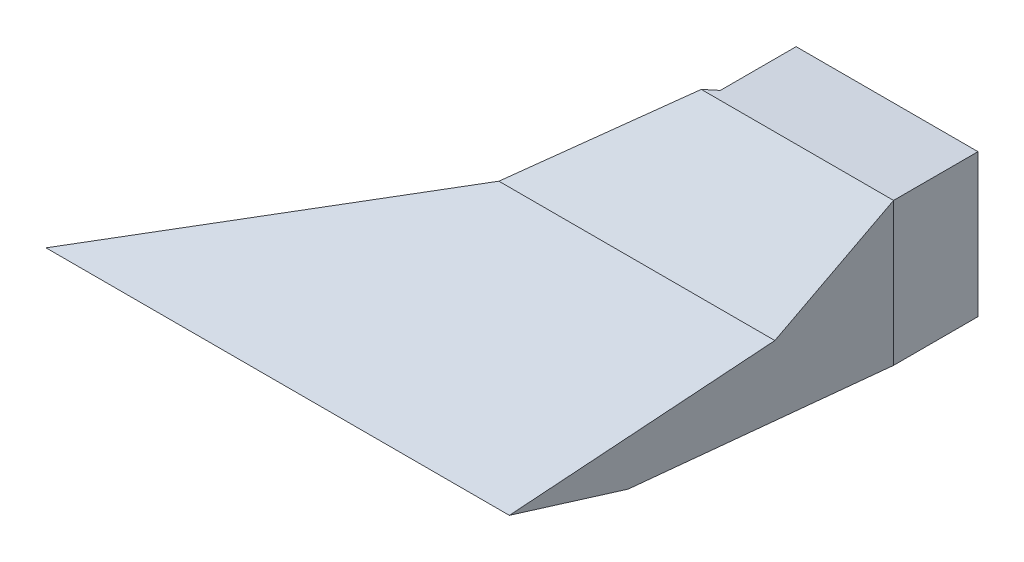
ISO-10303-21;
HEADER;
FILE_DESCRIPTION(('STEP AP214'),'2;1');
FILE_NAME('part.step','',(''),(''),'','','');
FILE_SCHEMA(('AUTOMOTIVE_DESIGN { 1 0 10303 214 1 1 1 1 }'));
ENDSEC;
DATA;
#1=APPLICATION_CONTEXT('core data for automotive mechanical design processes');
#2=APPLICATION_PROTOCOL_DEFINITION('international standard','automotive_design',2000,#1);
#3=PRODUCT_CONTEXT('',#1,'mechanical');
#4=PRODUCT('Part','Part','',(#3));
#5=PRODUCT_RELATED_PRODUCT_CATEGORY('part','',(#4));
#6=PRODUCT_DEFINITION_FORMATION('','',#4);
#7=PRODUCT_DEFINITION_CONTEXT('part definition',#1,'design');
#8=PRODUCT_DEFINITION('design','',#6,#7);
#9=PRODUCT_DEFINITION_SHAPE('','',#8);
#10=(LENGTH_UNIT() NAMED_UNIT(*) SI_UNIT(.MILLI.,.METRE.));
#11=(NAMED_UNIT(*) PLANE_ANGLE_UNIT() SI_UNIT($,.RADIAN.));
#12=(NAMED_UNIT(*) SI_UNIT($,.STERADIAN.) SOLID_ANGLE_UNIT());
#13=UNCERTAINTY_MEASURE_WITH_UNIT(LENGTH_MEASURE(1.E-05),#10,'distance_accuracy_value','');
#14=(GEOMETRIC_REPRESENTATION_CONTEXT(3) GLOBAL_UNCERTAINTY_ASSIGNED_CONTEXT((#13)) GLOBAL_UNIT_ASSIGNED_CONTEXT((#10,
#11,#12)) REPRESENTATION_CONTEXT('',''));
#15=CARTESIAN_POINT('',(0.,0.,0.));
#16=DIRECTION('',(0.,0.,1.));
#17=DIRECTION('',(1.,0.,0.));
#18=AXIS2_PLACEMENT_3D('',#15,#16,#17);
#19=CARTESIAN_POINT('',(50.,12.4,-7.9));
#20=DIRECTION('',(-1.,0.,0.));
#21=DIRECTION('',(0.,0.,1.));
#22=AXIS2_PLACEMENT_3D('',#19,#20,#21);
#23=PLANE('',#22);
#24=DIRECTION('',(0.,-1.,0.));
#25=VECTOR('',#24,1.);
#26=CARTESIAN_POINT('',(50.,12.4,-7.8));
#27=LINE('',#26,#25);
#28=CARTESIAN_POINT('',(50.,12.4,-7.8));
#29=VERTEX_POINT('',#28);
#30=CARTESIAN_POINT('',(50.,0.811035004039767,-7.8));
#31=VERTEX_POINT('',#30);
#32=EDGE_CURVE('E142',#29,#31,#27,.T.);
#33=ORIENTED_EDGE('',*,*,#32,.T.);
#34=DIRECTION('',(0.,0.,1.));
#35=VECTOR('',#34,1.);
#36=CARTESIAN_POINT('',(50.,0.811035004039767,-7.9));
#37=LINE('',#36,#35);
#38=CARTESIAN_POINT('',(50.,0.811035004039767,-7.9));
#39=VERTEX_POINT('',#38);
#40=EDGE_CURVE('E13',#39,#31,#37,.T.);
#41=ORIENTED_EDGE('',*,*,#40,.F.);
#42=DIRECTION('',(0.,-1.,0.));
#43=VECTOR('',#42,1.);
#44=CARTESIAN_POINT('',(50.,12.4,-7.9));
#45=LINE('',#44,#43);
#46=CARTESIAN_POINT('',(50.,12.4,-7.9));
#47=VERTEX_POINT('',#46);
#48=EDGE_CURVE('E130',#47,#39,#45,.T.);
#49=ORIENTED_EDGE('',*,*,#48,.F.);
#50=DIRECTION('',(0.,0.,1.));
#51=VECTOR('',#50,1.);
#52=CARTESIAN_POINT('',(50.,12.4,-7.9));
#53=LINE('',#52,#51);
#54=EDGE_CURVE('E138',#47,#29,#53,.T.);
#55=ORIENTED_EDGE('',*,*,#54,.T.);
#56=EDGE_LOOP('',(#33,#41,#49,#55));
#57=FACE_BOUND('',#56,.T.);
#58=ADVANCED_FACE('F79',(#57),#23,.F.);
#59=CARTESIAN_POINT('',(50.,0.811035004039767,-7.9));
#60=DIRECTION('',(0.,1.,0.));
#61=DIRECTION('',(0.,0.,1.));
#62=AXIS2_PLACEMENT_3D('',#59,#60,#61);
#63=PLANE('',#62);
#64=DIRECTION('',(-1.,0.,0.));
#65=VECTOR('',#64,1.);
#66=CARTESIAN_POINT('',(50.,0.811035004039767,-7.8));
#67=LINE('',#66,#65);
#68=CARTESIAN_POINT('',(34.8,0.811035004039767,-7.8));
#69=VERTEX_POINT('',#68);
#70=EDGE_CURVE('E134',#31,#69,#67,.T.);
#71=ORIENTED_EDGE('',*,*,#70,.T.);
#72=DIRECTION('',(0.,0.,1.));
#73=VECTOR('',#72,1.);
#74=CARTESIAN_POINT('',(34.8,0.811035004039767,-7.9));
#75=LINE('',#74,#73);
#76=CARTESIAN_POINT('',(34.8,0.811035004039767,-7.9));
#77=VERTEX_POINT('',#76);
#78=EDGE_CURVE('E87',#77,#69,#75,.T.);
#79=ORIENTED_EDGE('',*,*,#78,.F.);
#80=DIRECTION('',(-1.,0.,0.));
#81=VECTOR('',#80,1.);
#82=CARTESIAN_POINT('',(50.,0.811035004039767,-7.9));
#83=LINE('',#82,#81);
#84=EDGE_CURVE('E125',#39,#77,#83,.T.);
#85=ORIENTED_EDGE('',*,*,#84,.F.);
#86=ORIENTED_EDGE('',*,*,#40,.T.);
#87=EDGE_LOOP('',(#71,#79,#85,#86));
#88=FACE_BOUND('',#87,.T.);
#89=ADVANCED_FACE('F133',(#88),#63,.F.);
#90=CARTESIAN_POINT('',(34.8,12.4,-7.9));
#91=DIRECTION('',(1.,0.,0.));
#92=DIRECTION('',(0.,0.,-1.));
#93=AXIS2_PLACEMENT_3D('',#90,#91,#92);
#94=PLANE('',#93);
#95=DIRECTION('',(0.,1.,0.));
#96=VECTOR('',#95,1.);
#97=CARTESIAN_POINT('',(34.8,12.4,-7.8));
#98=LINE('',#97,#96);
#99=CARTESIAN_POINT('',(34.8,12.4,-7.8));
#100=VERTEX_POINT('',#99);
#101=EDGE_CURVE('E112',#69,#100,#98,.T.);
#102=ORIENTED_EDGE('',*,*,#101,.T.);
#103=DIRECTION('',(0.,0.,1.));
#104=VECTOR('',#103,1.);
#105=CARTESIAN_POINT('',(34.8,12.4,-7.9));
#106=LINE('',#105,#104);
#107=CARTESIAN_POINT('',(34.8,12.4,-7.9));
#108=VERTEX_POINT('',#107);
#109=EDGE_CURVE('E135',#108,#100,#106,.T.);
#110=ORIENTED_EDGE('',*,*,#109,.F.);
#111=DIRECTION('',(0.,1.,0.));
#112=VECTOR('',#111,1.);
#113=CARTESIAN_POINT('',(34.8,12.4,-7.9));
#114=LINE('',#113,#112);
#115=EDGE_CURVE('E128',#77,#108,#114,.T.);
#116=ORIENTED_EDGE('',*,*,#115,.F.);
#117=ORIENTED_EDGE('',*,*,#78,.T.);
#118=EDGE_LOOP('',(#102,#110,#116,#117));
#119=FACE_BOUND('',#118,.T.);
#120=ADVANCED_FACE('F136',(#119),#94,.F.);
#121=CARTESIAN_POINT('',(50.,12.4,-7.9));
#122=DIRECTION('',(0.,-1.,0.));
#123=DIRECTION('',(0.,0.,-1.));
#124=AXIS2_PLACEMENT_3D('',#121,#122,#123);
#125=PLANE('',#124);
#126=DIRECTION('',(1.,0.,0.));
#127=VECTOR('',#126,1.);
#128=CARTESIAN_POINT('',(50.,12.4,-7.8));
#129=LINE('',#128,#127);
#130=EDGE_CURVE('E118',#100,#29,#129,.T.);
#131=ORIENTED_EDGE('',*,*,#130,.T.);
#132=ORIENTED_EDGE('',*,*,#54,.F.);
#133=DIRECTION('',(1.,0.,0.));
#134=VECTOR('',#133,1.);
#135=CARTESIAN_POINT('',(50.,12.4,-7.9));
#136=LINE('',#135,#134);
#137=EDGE_CURVE('E95',#108,#47,#136,.T.);
#138=ORIENTED_EDGE('',*,*,#137,.F.);
#139=ORIENTED_EDGE('',*,*,#109,.T.);
#140=EDGE_LOOP('',(#131,#132,#138,#139));
#141=FACE_BOUND('',#140,.T.);
#142=ADVANCED_FACE('F149',(#141),#125,.F.);
#143=CARTESIAN_POINT('',(0.,0.,-7.9));
#144=DIRECTION('',(0.,0.,-1.));
#145=DIRECTION('',(-1.,0.,0.));
#146=AXIS2_PLACEMENT_3D('',#143,#144,#145);
#147=PLANE('',#146);
#148=ORIENTED_EDGE('',*,*,#48,.T.);
#149=ORIENTED_EDGE('',*,*,#84,.T.);
#150=ORIENTED_EDGE('',*,*,#115,.T.);
#151=ORIENTED_EDGE('',*,*,#137,.T.);
#152=EDGE_LOOP('',(#148,#149,#150,#151));
#153=FACE_BOUND('',#152,.T.);
#154=ADVANCED_FACE('F126',(#153),#147,.T.);
#155=CARTESIAN_POINT('',(0.,0.,-7.8));
#156=DIRECTION('',(0.,0.,-1.));
#157=DIRECTION('',(-1.,0.,0.));
#158=AXIS2_PLACEMENT_3D('',#155,#156,#157);
#159=PLANE('',#158);
#160=ORIENTED_EDGE('',*,*,#32,.F.);
#161=ORIENTED_EDGE('',*,*,#130,.F.);
#162=ORIENTED_EDGE('',*,*,#101,.F.);
#163=ORIENTED_EDGE('',*,*,#70,.F.);
#164=EDGE_LOOP('',(#160,#161,#162,#163));
#165=FACE_BOUND('',#164,.T.);
#166=ADVANCED_FACE('F152',(#165),#159,.F.);
#167=CLOSED_SHELL('',(#58,#89,#120,#142,#154,#166));
#168=MANIFOLD_SOLID_BREP('B2',#167);
#169=CARTESIAN_POINT('',(500000.,4.3108780250244,8.05331003636857));
#170=DIRECTION('',(0.,0.934304423232793,0.356476148890271));
#171=DIRECTION('',(0.,-0.356476148890271,0.934304423232793));
#172=AXIS2_PLACEMENT_3D('',#169,#170,#171);
#173=PLANE('',#172);
#174=DIRECTION('',(0.746771710863164,0.237085319362281,-0.621387611074914));
#175=VECTOR('',#174,1.);
#176=CARTESIAN_POINT('',(3.35260043874305,-2.43824431142607,25.742389296028));
#177=LINE('',#176,#175);
#178=CARTESIAN_POINT('',(3.35260043879571,-2.43824431143239,25.7423892959974));
#179=VERTEX_POINT('',#178);
#180=CARTESIAN_POINT('',(24.6109965621883,4.31087802505243,8.05331003634986));
#181=VERTEX_POINT('',#180);
#182=EDGE_CURVE('E224',#179,#181,#177,.T.);
#183=ORIENTED_EDGE('',*,*,#182,.T.);
#184=DIRECTION('',(-1.,0.,0.));
#185=VECTOR('',#184,1.);
#186=CARTESIAN_POINT('',(500000.,4.3108780250244,8.05331003636857));
#187=LINE('',#186,#185);
#188=CARTESIAN_POINT('',(47.6232973339279,4.3108780250169,8.05331003637117));
#189=VERTEX_POINT('',#188);
#190=EDGE_CURVE('E362',#189,#181,#187,.T.);
#191=ORIENTED_EDGE('',*,*,#190,.F.);
#192=DIRECTION('',(-0.262359194005535,-0.343988891430772,0.901576006719897));
#193=VECTOR('',#192,1.);
#194=CARTESIAN_POINT('',(42.4757639670978,-2.43824431142607,25.7423892960262));
#195=LINE('',#194,#193);
#196=CARTESIAN_POINT('',(42.4757639670013,-2.43824431142607,25.7423892960022));
#197=VERTEX_POINT('',#196);
#198=EDGE_CURVE('E481',#189,#197,#195,.T.);
#199=ORIENTED_EDGE('',*,*,#198,.T.);
#200=DIRECTION('',(-1.,0.,0.));
#201=VECTOR('',#200,1.);
#202=CARTESIAN_POINT('',(500000.,-2.43824431143155,25.7423892960052));
#203=LINE('',#202,#201);
#204=EDGE_CURVE('E417',#197,#179,#203,.T.);
#205=ORIENTED_EDGE('',*,*,#204,.T.);
#206=EDGE_LOOP('',(#183,#191,#199,#205));
#207=FACE_BOUND('',#206,.T.);
#208=ADVANCED_FACE('F207',(#207),#173,.F.);
#209=CARTESIAN_POINT('',(500000.,12.0878691271867,0.));
#210=DIRECTION('',(0.,0.719339800338652,0.694658370458996));
#211=DIRECTION('',(0.,-0.694658370458996,0.719339800338652));
#212=AXIS2_PLACEMENT_3D('',#209,#210,#211);
#213=PLANE('',#212);
#214=DIRECTION('',(0.653989150920572,0.525511784676704,-0.544183383285538));
#215=VECTOR('',#214,1.);
#216=CARTESIAN_POINT('',(24.610996562059,4.31087802503822,8.05331003633974));
#217=LINE('',#216,#215);
#218=CARTESIAN_POINT('',(34.289310076468,12.0878691271867,0.));
#219=VERTEX_POINT('',#218);
#220=EDGE_CURVE('E358',#181,#219,#217,.T.);
#221=ORIENTED_EDGE('',*,*,#220,.T.);
#222=DIRECTION('',(-1.,0.,0.));
#223=VECTOR('',#222,1.);
#224=CARTESIAN_POINT('',(500000.,12.0878691271867,0.));
#225=LINE('',#224,#223);
#226=CARTESIAN_POINT('',(34.8,12.0878691271867,0.));
#227=VERTEX_POINT('',#226);
#228=EDGE_CURVE('E355',#227,#219,#225,.T.);
#229=ORIENTED_EDGE('',*,*,#228,.F.);
#230=DIRECTION('',(0.,0.694658370458996,-0.719339800338652));
#231=VECTOR('',#230,1.);
#232=CARTESIAN_POINT('',(34.8,2.90200435136843,9.51224143374082));
#233=LINE('',#232,#231);
#234=CARTESIAN_POINT('',(34.8,12.4,-0.323220980668114));
#235=VERTEX_POINT('',#234);
#236=EDGE_CURVE('E344',#227,#235,#233,.T.);
#237=ORIENTED_EDGE('',*,*,#236,.T.);
#238=DIRECTION('',(1.,0.,0.));
#239=VECTOR('',#238,1.);
#240=CARTESIAN_POINT('',(50.,12.4,-0.323220980668119));
#241=LINE('',#240,#239);
#242=CARTESIAN_POINT('',(50.,12.4,-0.323220980668119));
#243=VERTEX_POINT('',#242);
#244=EDGE_CURVE('E555',#235,#243,#241,.T.);
#245=ORIENTED_EDGE('',*,*,#244,.T.);
#246=DIRECTION('',(0.,-0.694658370458996,0.719339800338652));
#247=VECTOR('',#246,1.);
#248=CARTESIAN_POINT('',(50.,2.90200435136843,9.51224143374082));
#249=LINE('',#248,#247);
#250=CARTESIAN_POINT('',(50.,12.0878691271867,0.));
#251=VERTEX_POINT('',#250);
#252=EDGE_CURVE('E553',#243,#251,#249,.T.);
#253=ORIENTED_EDGE('',*,*,#252,.T.);
#254=CARTESIAN_POINT('',(49.9668157,12.0878691271867,0.));
#255=VERTEX_POINT('',#254);
#256=EDGE_CURVE('E361',#251,#255,#225,.T.);
#257=ORIENTED_EDGE('',*,*,#256,.T.);
#258=DIRECTION('',(-0.204887549377378,-0.679921553624081,0.704079379777272));
#259=VECTOR('',#258,1.);
#260=CARTESIAN_POINT('',(47.6232973338611,4.31087802502401,8.05331003636846));
#261=LINE('',#260,#259);
#262=EDGE_CURVE('E479',#255,#189,#261,.T.);
#263=ORIENTED_EDGE('',*,*,#262,.T.);
#264=ORIENTED_EDGE('',*,*,#190,.T.);
#265=EDGE_LOOP('',(#221,#229,#237,#245,#253,#257,#263,#264));
#266=FACE_BOUND('',#265,.T.);
#267=ADVANCED_FACE('F356',(#266),#213,.F.);
#268=CARTESIAN_POINT('',(500000.,0.811035004039765,0.));
#269=DIRECTION('',(0.,-0.986393923832144,-0.164398987305357));
#270=DIRECTION('',(0.,0.164398987305357,-0.986393923832144));
#271=AXIS2_PLACEMENT_3D('',#268,#269,#270);
#272=PLANE('',#271);
#273=DIRECTION('',(-0.764356936022371,-0.106003375055101,0.636020250331246));
#274=VECTOR('',#273,1.);
#275=CARTESIAN_POINT('',(34.2893100765124,0.811035004043993,-4.1977519414938E-11));
#276=LINE('',#275,#274);
#277=CARTESIAN_POINT('',(34.289310076468,0.811035004039765,0.));
#278=VERTEX_POINT('',#277);
#279=CARTESIAN_POINT('',(11.455474554964,-2.35563166262691,19.));
#280=VERTEX_POINT('',#279);
#281=EDGE_CURVE('E232',#278,#280,#276,.T.);
#282=ORIENTED_EDGE('',*,*,#281,.T.);
#283=DIRECTION('',(-1.,0.,0.));
#284=VECTOR('',#283,1.);
#285=CARTESIAN_POINT('',(500000.,-2.35563166262691,19.));
#286=LINE('',#285,#284);
#287=CARTESIAN_POINT('',(44.4378035601858,-2.35563166262691,19.));
#288=VERTEX_POINT('',#287);
#289=EDGE_CURVE('E405',#288,#280,#286,.T.);
#290=ORIENTED_EDGE('',*,*,#289,.F.);
#291=DIRECTION('',(0.275900130811224,0.158018055572697,-0.948108333436308));
#292=VECTOR('',#291,1.);
#293=CARTESIAN_POINT('',(49.9668157,0.811035004039765,0.));
#294=LINE('',#293,#292);
#295=CARTESIAN_POINT('',(49.966815700017,0.811035004039765,-4.21446934100766E-12));
#296=VERTEX_POINT('',#295);
#297=EDGE_CURVE('E470',#288,#296,#294,.T.);
#298=ORIENTED_EDGE('',*,*,#297,.T.);
#299=DIRECTION('',(-1.,0.,0.));
#300=VECTOR('',#299,1.);
#301=CARTESIAN_POINT('',(500000.,0.811035004039765,0.));
#302=LINE('',#301,#300);
#303=CARTESIAN_POINT('',(34.8000000000184,0.811035004039765,0.));
#304=VERTEX_POINT('',#303);
#305=EDGE_CURVE('E412',#296,#304,#302,.T.);
#306=ORIENTED_EDGE('',*,*,#305,.T.);
#307=EDGE_CURVE('E366',#304,#278,#302,.T.);
#308=ORIENTED_EDGE('',*,*,#307,.T.);
#309=EDGE_LOOP('',(#282,#290,#298,#306,#308));
#310=FACE_BOUND('',#309,.T.);
#311=ADVANCED_FACE('F587',(#310),#272,.F.);
#312=CARTESIAN_POINT('',(500000.,-2.35563166262691,19.));
#313=DIRECTION('',(0.,0.,-1.));
#314=DIRECTION('',(-1.,0.,0.));
#315=AXIS2_PLACEMENT_3D('',#312,#313,#314);
#316=PLANE('',#315);
#317=DIRECTION('',(3.84146596304198E-12,-1.,-3.19979570195479E-12));
#318=VECTOR('',#317,1.);
#319=CARTESIAN_POINT('',(11.4554745549304,-2.35563166262691,19.0000000000025));
#320=LINE('',#319,#318);
#321=CARTESIAN_POINT('',(11.4554745549335,-3.16666666666666,19.));
#322=VERTEX_POINT('',#321);
#323=EDGE_CURVE('E545',#280,#322,#320,.T.);
#324=ORIENTED_EDGE('',*,*,#323,.T.);
#325=DIRECTION('',(-1.,0.,0.));
#326=VECTOR('',#325,1.);
#327=CARTESIAN_POINT('',(0.8,-3.16666666666666,19.));
#328=LINE('',#327,#326);
#329=CARTESIAN_POINT('',(44.4378035601858,-3.16666666666666,19.));
#330=VERTEX_POINT('',#329);
#331=EDGE_CURVE('E438',#330,#322,#328,.T.);
#332=ORIENTED_EDGE('',*,*,#331,.F.);
#333=DIRECTION('',(0.,1.,0.));
#334=VECTOR('',#333,1.);
#335=CARTESIAN_POINT('',(44.437803560201,-2.35563166262691,19.0000000000026));
#336=LINE('',#335,#334);
#337=EDGE_CURVE('E486',#330,#288,#336,.T.);
#338=ORIENTED_EDGE('',*,*,#337,.T.);
#339=ORIENTED_EDGE('',*,*,#289,.T.);
#340=EDGE_LOOP('',(#324,#332,#338,#339));
#341=FACE_BOUND('',#340,.T.);
#342=ADVANCED_FACE('F585',(#341),#316,.F.);
#343=CARTESIAN_POINT('',(0.,0.,0.));
#344=DIRECTION('',(0.,0.,1.));
#345=DIRECTION('',(1.,0.,0.));
#346=AXIS2_PLACEMENT_3D('',#343,#344,#345);
#347=PLANE('',#346);
#348=ORIENTED_EDGE('',*,*,#228,.T.);
#349=DIRECTION('',(5.08933543337628E-12,-1.,-4.23649793964402E-12));
#350=VECTOR('',#349,1.);
#351=CARTESIAN_POINT('',(34.289310076455,12.0878691271867,5.79676511346331E-12));
#352=LINE('',#351,#350);
#353=EDGE_CURVE('E550',#219,#278,#352,.T.);
#354=ORIENTED_EDGE('',*,*,#353,.T.);
#355=ORIENTED_EDGE('',*,*,#307,.F.);
#356=DIRECTION('',(0.,1.,0.));
#357=VECTOR('',#356,1.);
#358=CARTESIAN_POINT('',(34.8,0.811035004039765,0.));
#359=LINE('',#358,#357);
#360=EDGE_CURVE('E348',#304,#227,#359,.T.);
#361=ORIENTED_EDGE('',*,*,#360,.T.);
#362=EDGE_LOOP('',(#348,#354,#355,#361));
#363=FACE_BOUND('',#362,.T.);
#364=ADVANCED_FACE('F365',(#363),#347,.T.);
#365=CARTESIAN_POINT('',(0.8,13.2,0.));
#366=DIRECTION('',(0.,0.719339800338653,0.694658370458996));
#367=DIRECTION('',(0.,-0.694658370458996,0.719339800338653));
#368=AXIS2_PLACEMENT_3D('',#365,#366,#367);
#369=PLANE('',#368);
#370=DIRECTION('',(-1.,0.,0.));
#371=VECTOR('',#370,1.);
#372=CARTESIAN_POINT('',(0.8,13.2,0.));
#373=LINE('',#372,#371);
#374=CARTESIAN_POINT('',(50.8,13.2,0.));
#375=VERTEX_POINT('',#374);
#376=CARTESIAN_POINT('',(33.0385753464619,13.2,0.));
#377=VERTEX_POINT('',#376);
#378=EDGE_CURVE('E77',#375,#377,#373,.T.);
#379=ORIENTED_EDGE('',*,*,#378,.T.);
#380=DIRECTION('',(-0.653989150921028,-0.525511784675744,0.544183383285917));
#381=VECTOR('',#380,1.);
#382=CARTESIAN_POINT('',(19.2500783343557,2.12027847461479,11.4733875078943));
#383=LINE('',#382,#381);
#384=CARTESIAN_POINT('',(22.8338355215285,5.,8.4913485730827));
#385=VERTEX_POINT('',#384);
#386=EDGE_CURVE('E467',#377,#385,#383,.T.);
#387=ORIENTED_EDGE('',*,*,#386,.T.);
#388=DIRECTION('',(-1.,0.,0.));
#389=VECTOR('',#388,1.);
#390=CARTESIAN_POINT('',(0.8,5.,8.4913485730827));
#391=LINE('',#390,#389);
#392=CARTESIAN_POINT('',(48.3290121397983,5.,8.4913485730827));
#393=VERTEX_POINT('',#392);
#394=EDGE_CURVE('E216',#393,#385,#391,.T.);
#395=ORIENTED_EDGE('',*,*,#394,.F.);
#396=DIRECTION('',(-0.204887549377384,-0.679921553624057,0.704079379777294));
#397=VECTOR('',#396,1.);
#398=CARTESIAN_POINT('',(48.7010546055065,6.23462695545516,7.21285493448592));
#399=LINE('',#398,#397);
#400=EDGE_CURVE('E465',#375,#393,#399,.T.);
#401=ORIENTED_EDGE('',*,*,#400,.F.);
#402=EDGE_LOOP('',(#379,#387,#395,#401));
#403=FACE_BOUND('',#402,.T.);
#404=ADVANCED_FACE('F464',(#403),#369,.T.);
#405=CARTESIAN_POINT('',(0.8,5.,8.4913485730827));
#406=DIRECTION('',(0.,0.934304423232793,0.356476148890271));
#407=DIRECTION('',(0.,-0.356476148890271,0.934304423232793));
#408=AXIS2_PLACEMENT_3D('',#405,#406,#407);
#409=PLANE('',#408);
#410=ORIENTED_EDGE('',*,*,#394,.T.);
#411=DIRECTION('',(-0.746771710863093,-0.237085319362657,0.621387611074855));
#412=VECTOR('',#411,1.);
#413=CARTESIAN_POINT('',(10.5462707951112,1.09894005761818,18.7158125962999));
#414=LINE('',#413,#412);
#415=CARTESIAN_POINT('',(0.,-2.24929333576275,27.4913485730827));
#416=VERTEX_POINT('',#415);
#417=EDGE_CURVE('E459',#385,#416,#414,.T.);
#418=ORIENTED_EDGE('',*,*,#417,.T.);
#419=DIRECTION('',(-1.,0.,0.));
#420=VECTOR('',#419,1.);
#421=CARTESIAN_POINT('',(0.8,-2.24929333576275,27.4913485730827));
#422=LINE('',#421,#420);
#423=CARTESIAN_POINT('',(42.8,-2.24929333576275,27.4913485730827));
#424=VERTEX_POINT('',#423);
#425=EDGE_CURVE('E448',#424,#416,#422,.T.);
#426=ORIENTED_EDGE('',*,*,#425,.F.);
#427=DIRECTION('',(-0.262359194005471,-0.343988891431398,0.901576006719677));
#428=VECTOR('',#427,1.);
#429=CARTESIAN_POINT('',(45.0574786988718,0.710570899216936,19.7337068472086));
#430=LINE('',#429,#428);
#431=EDGE_CURVE('E460',#393,#424,#430,.T.);
#432=ORIENTED_EDGE('',*,*,#431,.F.);
#433=EDGE_LOOP('',(#410,#418,#426,#432));
#434=FACE_BOUND('',#433,.T.);
#435=ADVANCED_FACE('F457',(#434),#409,.T.);
#436=CARTESIAN_POINT('',(0.8,-2.24929333576275,27.4913485730827));
#437=DIRECTION('',(0.,-0.994214680914687,0.107411211024301));
#438=DIRECTION('',(0.,-0.107411211024301,-0.994214680914687));
#439=AXIS2_PLACEMENT_3D('',#436,#437,#438);
#440=PLANE('',#439);
#441=ORIENTED_EDGE('',*,*,#425,.T.);
#442=DIRECTION('',(0.766859141336965,-0.0689381735243799,-0.638102331588794));
#443=VECTOR('',#442,1.);
#444=CARTESIAN_POINT('',(0.470458354121657,-2.29158603060614,27.0998808882128));
#445=LINE('',#444,#443);
#446=CARTESIAN_POINT('',(10.2047398249335,-3.16666666666666,18.9999999999999));
#447=VERTEX_POINT('',#446);
#448=EDGE_CURVE('E474',#416,#447,#445,.T.);
#449=ORIENTED_EDGE('',*,*,#448,.T.);
#450=DIRECTION('',(-1.,0.,0.));
#451=VECTOR('',#450,1.);
#452=CARTESIAN_POINT('',(11.4554745549335,-3.16666666666666,18.9999999999999));
#453=LINE('',#452,#451);
#454=EDGE_CURVE('E534',#322,#447,#453,.T.);
#455=ORIENTED_EDGE('',*,*,#454,.F.);
#456=DIRECTION('',(-0.76685914133695,0.0689381735246631,0.638102331588781));
#457=VECTOR('',#456,1.);
#458=CARTESIAN_POINT('',(11.4554745549335,-3.16666666666666,18.9999999999999));
#459=LINE('',#458,#457);
#460=EDGE_CURVE('E544',#322,#179,#459,.T.);
#461=ORIENTED_EDGE('',*,*,#460,.T.);
#462=ORIENTED_EDGE('',*,*,#204,.F.);
#463=DIRECTION('',(0.277919294267923,-0.10317968485909,-0.955047024238073));
#464=VECTOR('',#463,1.);
#465=CARTESIAN_POINT('',(44.437803560201,-3.16666666666667,19.0000000000026));
#466=LINE('',#465,#464);
#467=EDGE_CURVE('E483',#197,#330,#466,.T.);
#468=ORIENTED_EDGE('',*,*,#467,.T.);
#469=CARTESIAN_POINT('',(45.270987860201,-3.16666666666667,19.0000000000026));
#470=VERTEX_POINT('',#469);
#471=EDGE_CURVE('E443',#470,#330,#328,.T.);
#472=ORIENTED_EDGE('',*,*,#471,.F.);
#473=DIRECTION('',(0.277919294267936,-0.103179684858601,-0.955047024238122));
#474=VECTOR('',#473,1.);
#475=CARTESIAN_POINT('',(39.5559563666917,-1.04491707741774,38.6392403617786));
#476=LINE('',#475,#474);
#477=EDGE_CURVE('E491',#424,#470,#476,.T.);
#478=ORIENTED_EDGE('',*,*,#477,.F.);
#479=EDGE_LOOP('',(#441,#449,#455,#461,#462,#468,#472,#478));
#480=FACE_BOUND('',#479,.T.);
#481=ADVANCED_FACE('F540',(#480),#440,.T.);
#482=CARTESIAN_POINT('',(0.8,-1.,6.));
#483=DIRECTION('',(0.,-0.986393923832144,-0.164398987305357));
#484=DIRECTION('',(0.,0.164398987305357,-0.986393923832144));
#485=AXIS2_PLACEMENT_3D('',#482,#483,#484);
#486=PLANE('',#485);
#487=ORIENTED_EDGE('',*,*,#331,.T.);
#488=ORIENTED_EDGE('',*,*,#454,.T.);
#489=DIRECTION('',(0.764356936022362,0.106003375055206,-0.636020250331239));
#490=VECTOR('',#489,1.);
#491=CARTESIAN_POINT('',(11.2055575476944,-3.02787018111397,18.1672210866838));
#492=LINE('',#491,#490);
#493=CARTESIAN_POINT('',(33.0385753464619,0.,0.));
#494=VERTEX_POINT('',#493);
#495=EDGE_CURVE('E531',#447,#494,#492,.T.);
#496=ORIENTED_EDGE('',*,*,#495,.T.);
#497=DIRECTION('',(-1.,0.,0.));
#498=VECTOR('',#497,1.);
#499=CARTESIAN_POINT('',(0.8,0.,0.));
#500=LINE('',#499,#498);
#501=CARTESIAN_POINT('',(50.8,0.,0.));
#502=VERTEX_POINT('',#501);
#503=EDGE_CURVE('E431',#502,#494,#500,.T.);
#504=ORIENTED_EDGE('',*,*,#503,.F.);
#505=DIRECTION('',(0.275900130811223,0.158018055572717,-0.948108333436305));
#506=VECTOR('',#505,1.);
#507=CARTESIAN_POINT('',(45.3808594094047,-3.10373922797074,18.6224353678245));
#508=LINE('',#507,#506);
#509=EDGE_CURVE('E488',#470,#502,#508,.T.);
#510=ORIENTED_EDGE('',*,*,#509,.F.);
#511=ORIENTED_EDGE('',*,*,#471,.T.);
#512=EDGE_LOOP('',(#487,#488,#496,#504,#510,#511));
#513=FACE_BOUND('',#512,.T.);
#514=ADVANCED_FACE('F209',(#513),#486,.T.);
#515=CARTESIAN_POINT('',(0.,13.2,-0.8));
#516=DIRECTION('',(0.,-1.,0.));
#517=DIRECTION('',(1.,0.,0.));
#518=AXIS2_PLACEMENT_3D('',#515,#516,#517);
#519=PLANE('',#518);
#520=DIRECTION('',(-0.76868790047924,0.,0.639624039304979));
#521=VECTOR('',#520,1.);
#522=CARTESIAN_POINT('',(34.,13.2,-0.800000000000002));
#523=LINE('',#522,#521);
#524=CARTESIAN_POINT('',(34.,13.2,-0.8));
#525=VERTEX_POINT('',#524);
#526=EDGE_CURVE('E426',#525,#377,#523,.T.);
#527=ORIENTED_EDGE('',*,*,#526,.T.);
#528=ORIENTED_EDGE('',*,*,#378,.F.);
#529=DIRECTION('',(0.,0.,1.));
#530=VECTOR('',#529,1.);
#531=CARTESIAN_POINT('',(50.8,13.2,-0.8));
#532=LINE('',#531,#530);
#533=CARTESIAN_POINT('',(50.8,13.2,-7.8));
#534=VERTEX_POINT('',#533);
#535=EDGE_CURVE('E400',#534,#375,#532,.T.);
#536=ORIENTED_EDGE('',*,*,#535,.F.);
#537=DIRECTION('',(1.,0.,0.));
#538=VECTOR('',#537,1.);
#539=CARTESIAN_POINT('',(50.8,13.2,-7.8));
#540=LINE('',#539,#538);
#541=CARTESIAN_POINT('',(34.,13.2,-7.8));
#542=VERTEX_POINT('',#541);
#543=EDGE_CURVE('E393',#542,#534,#540,.T.);
#544=ORIENTED_EDGE('',*,*,#543,.F.);
#545=DIRECTION('',(0.,0.,1.));
#546=VECTOR('',#545,1.);
#547=CARTESIAN_POINT('',(34.,13.2,-7.8));
#548=LINE('',#547,#546);
#549=EDGE_CURVE('E374',#542,#525,#548,.T.);
#550=ORIENTED_EDGE('',*,*,#549,.T.);
#551=EDGE_LOOP('',(#527,#528,#536,#544,#550));
#552=FACE_BOUND('',#551,.T.);
#553=ADVANCED_FACE('F521',(#552),#519,.F.);
#554=CARTESIAN_POINT('',(0.,0.,-0.8));
#555=DIRECTION('',(0.,1.,0.));
#556=DIRECTION('',(0.,0.,1.));
#557=AXIS2_PLACEMENT_3D('',#554,#555,#556);
#558=PLANE('',#557);
#559=DIRECTION('',(-0.76868790047924,0.,0.639624039304979));
#560=VECTOR('',#559,1.);
#561=CARTESIAN_POINT('',(13.9100429963318,0.,15.9168228355594));
#562=LINE('',#561,#560);
#563=CARTESIAN_POINT('',(34.,0.,-0.800000000000019));
#564=VERTEX_POINT('',#563);
#565=EDGE_CURVE('E527',#564,#494,#562,.T.);
#566=ORIENTED_EDGE('',*,*,#565,.F.);
#567=DIRECTION('',(0.,0.,1.));
#568=VECTOR('',#567,1.);
#569=CARTESIAN_POINT('',(34.,0.,-7.8));
#570=LINE('',#569,#568);
#571=CARTESIAN_POINT('',(34.,0.,-7.8));
#572=VERTEX_POINT('',#571);
#573=EDGE_CURVE('E369',#572,#564,#570,.T.);
#574=ORIENTED_EDGE('',*,*,#573,.F.);
#575=DIRECTION('',(-1.,0.,0.));
#576=VECTOR('',#575,1.);
#577=CARTESIAN_POINT('',(50.8,0.,-7.8));
#578=LINE('',#577,#576);
#579=CARTESIAN_POINT('',(50.8,0.,-7.8));
#580=VERTEX_POINT('',#579);
#581=EDGE_CURVE('E511',#580,#572,#578,.T.);
#582=ORIENTED_EDGE('',*,*,#581,.F.);
#583=DIRECTION('',(0.,0.,1.));
#584=VECTOR('',#583,1.);
#585=CARTESIAN_POINT('',(50.8,0.,-0.8));
#586=LINE('',#585,#584);
#587=EDGE_CURVE('E397',#580,#502,#586,.T.);
#588=ORIENTED_EDGE('',*,*,#587,.T.);
#589=ORIENTED_EDGE('',*,*,#503,.T.);
#590=EDGE_LOOP('',(#566,#574,#582,#588,#589));
#591=FACE_BOUND('',#590,.T.);
#592=ADVANCED_FACE('F529',(#591),#558,.F.);
#593=CARTESIAN_POINT('',(50.,0.,0.));
#594=DIRECTION('',(1.,0.,0.));
#595=DIRECTION('',(0.,0.,-1.));
#596=AXIS2_PLACEMENT_3D('',#593,#594,#595);
#597=PLANE('',#596);
#598=DIRECTION('',(0.,0.,1.));
#599=VECTOR('',#598,1.);
#600=CARTESIAN_POINT('',(50.,0.811035004039765,-0.8));
#601=LINE('',#600,#599);
#602=CARTESIAN_POINT('',(50.,0.811035004039765,-7.8));
#603=VERTEX_POINT('',#602);
#604=CARTESIAN_POINT('',(50.,0.811035004039765,0.));
#605=VERTEX_POINT('',#604);
#606=EDGE_CURVE('E371',#603,#605,#601,.T.);
#607=ORIENTED_EDGE('',*,*,#606,.T.);
#608=DIRECTION('',(0.,1.,0.));
#609=VECTOR('',#608,1.);
#610=CARTESIAN_POINT('',(50.,0.,0.));
#611=LINE('',#610,#609);
#612=EDGE_CURVE('E497',#605,#251,#611,.T.);
#613=ORIENTED_EDGE('',*,*,#612,.T.);
#614=ORIENTED_EDGE('',*,*,#252,.F.);
#615=DIRECTION('',(0.,0.,-1.));
#616=VECTOR('',#615,1.);
#617=CARTESIAN_POINT('',(50.,12.4,18.3829279346442));
#618=LINE('',#617,#616);
#619=CARTESIAN_POINT('',(50.,12.4,-7.8));
#620=VERTEX_POINT('',#619);
#621=EDGE_CURVE('E556',#243,#620,#618,.T.);
#622=ORIENTED_EDGE('',*,*,#621,.T.);
#623=DIRECTION('',(0.,-1.,0.));
#624=VECTOR('',#623,1.);
#625=CARTESIAN_POINT('',(50.,12.0878691271867,-7.8));
#626=LINE('',#625,#624);
#627=EDGE_CURVE('E504',#620,#603,#626,.T.);
#628=ORIENTED_EDGE('',*,*,#627,.T.);
#629=EDGE_LOOP('',(#607,#613,#614,#622,#628));
#630=FACE_BOUND('',#629,.T.);
#631=ADVANCED_FACE('F570',(#630),#597,.F.);
#632=CARTESIAN_POINT('',(50.8,0.,0.));
#633=DIRECTION('',(1.,0.,0.));
#634=DIRECTION('',(0.,0.,-1.));
#635=AXIS2_PLACEMENT_3D('',#632,#633,#634);
#636=PLANE('',#635);
#637=DIRECTION('',(0.,1.,0.));
#638=VECTOR('',#637,1.);
#639=CARTESIAN_POINT('',(50.8,0.811035004039765,0.));
#640=LINE('',#639,#638);
#641=EDGE_CURVE('E495',#502,#375,#640,.T.);
#642=ORIENTED_EDGE('',*,*,#641,.F.);
#643=ORIENTED_EDGE('',*,*,#587,.F.);
#644=DIRECTION('',(0.,-1.,0.));
#645=VECTOR('',#644,1.);
#646=CARTESIAN_POINT('',(50.8,13.2,-7.8));
#647=LINE('',#646,#645);
#648=EDGE_CURVE('E387',#534,#580,#647,.T.);
#649=ORIENTED_EDGE('',*,*,#648,.F.);
#650=ORIENTED_EDGE('',*,*,#535,.T.);
#651=EDGE_LOOP('',(#642,#643,#649,#650));
#652=FACE_BOUND('',#651,.T.);
#653=ADVANCED_FACE('F591',(#652),#636,.T.);
#654=CARTESIAN_POINT('',(50.,0.811035004039765,-0.8));
#655=DIRECTION('',(0.,1.,0.));
#656=DIRECTION('',(0.,0.,1.));
#657=AXIS2_PLACEMENT_3D('',#654,#655,#656);
#658=PLANE('',#657);
#659=EDGE_CURVE('E410',#605,#296,#302,.T.);
#660=ORIENTED_EDGE('',*,*,#659,.F.);
#661=ORIENTED_EDGE('',*,*,#606,.F.);
#662=DIRECTION('',(-1.,0.,0.));
#663=VECTOR('',#662,1.);
#664=CARTESIAN_POINT('',(34.8,0.811035004039767,-7.8));
#665=LINE('',#664,#663);
#666=CARTESIAN_POINT('',(34.8,0.811035004039767,-7.8));
#667=VERTEX_POINT('',#666);
#668=EDGE_CURVE('E388',#603,#667,#665,.T.);
#669=ORIENTED_EDGE('',*,*,#668,.T.);
#670=DIRECTION('',(0.,0.,1.));
#671=VECTOR('',#670,1.);
#672=CARTESIAN_POINT('',(34.8,0.811035004039765,-0.8));
#673=LINE('',#672,#671);
#674=EDGE_CURVE('E368',#667,#304,#673,.T.);
#675=ORIENTED_EDGE('',*,*,#674,.T.);
#676=ORIENTED_EDGE('',*,*,#305,.F.);
#677=EDGE_LOOP('',(#660,#661,#669,#675,#676));
#678=FACE_BOUND('',#677,.T.);
#679=ADVANCED_FACE('F589',(#678),#658,.T.);
#680=CARTESIAN_POINT('',(34.8,0.811035004039765,-0.8));
#681=DIRECTION('',(1.,0.,0.));
#682=DIRECTION('',(0.,0.,-1.));
#683=AXIS2_PLACEMENT_3D('',#680,#681,#682);
#684=PLANE('',#683);
#685=ORIENTED_EDGE('',*,*,#360,.F.);
#686=ORIENTED_EDGE('',*,*,#674,.F.);
#687=DIRECTION('',(0.,1.,0.));
#688=VECTOR('',#687,1.);
#689=CARTESIAN_POINT('',(34.8,12.0878691271867,-7.8));
#690=LINE('',#689,#688);
#691=CARTESIAN_POINT('',(34.8,12.4,-7.8));
#692=VERTEX_POINT('',#691);
#693=EDGE_CURVE('E500',#667,#692,#690,.T.);
#694=ORIENTED_EDGE('',*,*,#693,.T.);
#695=DIRECTION('',(0.,0.,-1.));
#696=VECTOR('',#695,1.);
#697=CARTESIAN_POINT('',(34.8,12.4,18.3829279346442));
#698=LINE('',#697,#696);
#699=EDGE_CURVE('E350',#235,#692,#698,.T.);
#700=ORIENTED_EDGE('',*,*,#699,.F.);
#701=ORIENTED_EDGE('',*,*,#236,.F.);
#702=EDGE_LOOP('',(#685,#686,#694,#700,#701));
#703=FACE_BOUND('',#702,.T.);
#704=ADVANCED_FACE('F346',(#703),#684,.T.);
#705=CARTESIAN_POINT('',(0.,0.,-7.8));
#706=DIRECTION('',(0.,0.,-1.));
#707=DIRECTION('',(-1.,0.,0.));
#708=AXIS2_PLACEMENT_3D('',#705,#706,#707);
#709=PLANE('',#708);
#710=DIRECTION('',(1.,0.,0.));
#711=VECTOR('',#710,1.);
#712=CARTESIAN_POINT('',(50.,12.4,-7.8));
#713=LINE('',#712,#711);
#714=EDGE_CURVE('E353',#692,#620,#713,.T.);
#715=ORIENTED_EDGE('',*,*,#714,.F.);
#716=ORIENTED_EDGE('',*,*,#693,.F.);
#717=ORIENTED_EDGE('',*,*,#668,.F.);
#718=ORIENTED_EDGE('',*,*,#627,.F.);
#719=EDGE_LOOP('',(#715,#716,#717,#718));
#720=FACE_BOUND('',#719,.T.);
#721=ORIENTED_EDGE('',*,*,#648,.T.);
#722=ORIENTED_EDGE('',*,*,#581,.T.);
#723=DIRECTION('',(0.,1.,0.));
#724=VECTOR('',#723,1.);
#725=CARTESIAN_POINT('',(34.,13.2,-7.8));
#726=LINE('',#725,#724);
#727=EDGE_CURVE('E512',#572,#542,#726,.T.);
#728=ORIENTED_EDGE('',*,*,#727,.T.);
#729=ORIENTED_EDGE('',*,*,#543,.T.);
#730=EDGE_LOOP('',(#721,#722,#728,#729));
#731=FACE_BOUND('',#730,.T.);
#732=ADVANCED_FACE('F567',(#720,#731),#709,.T.);
#733=CARTESIAN_POINT('',(34.,13.2,-7.8));
#734=DIRECTION('',(1.,0.,0.));
#735=DIRECTION('',(0.,0.,-1.));
#736=AXIS2_PLACEMENT_3D('',#733,#734,#735);
#737=PLANE('',#736);
#738=DIRECTION('',(0.,1.,0.));
#739=VECTOR('',#738,1.);
#740=CARTESIAN_POINT('',(34.,13.2,-0.8));
#741=LINE('',#740,#739);
#742=EDGE_CURVE('E383',#564,#525,#741,.T.);
#743=ORIENTED_EDGE('',*,*,#742,.T.);
#744=ORIENTED_EDGE('',*,*,#549,.F.);
#745=ORIENTED_EDGE('',*,*,#727,.F.);
#746=ORIENTED_EDGE('',*,*,#573,.T.);
#747=EDGE_LOOP('',(#743,#744,#745,#746));
#748=FACE_BOUND('',#747,.T.);
#749=ADVANCED_FACE('F523',(#748),#737,.F.);
#750=CARTESIAN_POINT('',(46.8340300827827,0.,13.6287326780728));
#751=DIRECTION('',(-0.960171716954331,0.,-0.279410583122708));
#752=DIRECTION('',(-0.279410583122708,0.,0.960171716954331));
#753=AXIS2_PLACEMENT_3D('',#750,#751,#752);
#754=PLANE('',#753);
#755=ORIENTED_EDGE('',*,*,#509,.T.);
#756=ORIENTED_EDGE('',*,*,#641,.T.);
#757=ORIENTED_EDGE('',*,*,#400,.T.);
#758=ORIENTED_EDGE('',*,*,#431,.T.);
#759=ORIENTED_EDGE('',*,*,#477,.T.);
#760=EDGE_LOOP('',(#755,#756,#757,#758,#759));
#761=FACE_BOUND('',#760,.T.);
#762=ADVANCED_FACE('F668',(#761),#754,.F.);
#763=CARTESIAN_POINT('',(49.9668157,12.0878691271867,0.));
#764=DIRECTION('',(0.,0.,-1.));
#765=DIRECTION('',(0.,1.,0.));
#766=AXIS2_PLACEMENT_3D('',#763,#764,#765);
#767=PLANE('',#766);
#768=ORIENTED_EDGE('',*,*,#612,.F.);
#769=ORIENTED_EDGE('',*,*,#659,.T.);
#770=DIRECTION('',(0.,1.,0.));
#771=VECTOR('',#770,1.);
#772=CARTESIAN_POINT('',(49.9668157,12.0878691271867,0.));
#773=LINE('',#772,#771);
#774=EDGE_CURVE('E472',#296,#255,#773,.T.);
#775=ORIENTED_EDGE('',*,*,#774,.T.);
#776=ORIENTED_EDGE('',*,*,#256,.F.);
#777=EDGE_LOOP('',(#768,#769,#775,#776));
#778=FACE_BOUND('',#777,.T.);
#779=ADVANCED_FACE('F575',(#778),#767,.T.);
#780=CARTESIAN_POINT('',(46.0008457827827,-1.16602032744353E-13,13.6287326780728));
#781=DIRECTION('',(0.960171716954331,0.,0.279410583122708));
#782=DIRECTION('',(0.279410583122708,0.,-0.960171716954331));
#783=AXIS2_PLACEMENT_3D('',#780,#781,#782);
#784=PLANE('',#783);
#785=ORIENTED_EDGE('',*,*,#297,.F.);
#786=ORIENTED_EDGE('',*,*,#337,.F.);
#787=ORIENTED_EDGE('',*,*,#467,.F.);
#788=ORIENTED_EDGE('',*,*,#198,.F.);
#789=ORIENTED_EDGE('',*,*,#262,.F.);
#790=ORIENTED_EDGE('',*,*,#774,.F.);
#791=EDGE_LOOP('',(#785,#786,#787,#788,#789,#790));
#792=FACE_BOUND('',#791,.T.);
#793=ADVANCED_FACE('F578',(#792),#784,.F.);
#794=CARTESIAN_POINT('',(13.5167059884363,0.,16.2441179648849));
#795=DIRECTION('',(-0.639624039304979,0.,-0.76868790047924));
#796=DIRECTION('',(-0.76868790047924,0.,0.639624039304979));
#797=AXIS2_PLACEMENT_3D('',#794,#795,#796);
#798=PLANE('',#797);
#799=ORIENTED_EDGE('',*,*,#495,.F.);
#800=ORIENTED_EDGE('',*,*,#448,.F.);
#801=ORIENTED_EDGE('',*,*,#417,.F.);
#802=ORIENTED_EDGE('',*,*,#386,.F.);
#803=ORIENTED_EDGE('',*,*,#526,.F.);
#804=ORIENTED_EDGE('',*,*,#742,.F.);
#805=ORIENTED_EDGE('',*,*,#565,.T.);
#806=EDGE_LOOP('',(#799,#800,#801,#802,#803,#804,#805));
#807=FACE_BOUND('',#806,.T.);
#808=ADVANCED_FACE('F526',(#807),#798,.T.);
#809=CARTESIAN_POINT('',(14.7674407184363,0.,16.2441179648849));
#810=DIRECTION('',(-0.639624039304979,0.,-0.76868790047924));
#811=DIRECTION('',(-0.76868790047924,0.,0.639624039304979));
#812=AXIS2_PLACEMENT_3D('',#809,#810,#811);
#813=PLANE('',#812);
#814=ORIENTED_EDGE('',*,*,#220,.F.);
#815=ORIENTED_EDGE('',*,*,#182,.F.);
#816=ORIENTED_EDGE('',*,*,#460,.F.);
#817=ORIENTED_EDGE('',*,*,#323,.F.);
#818=ORIENTED_EDGE('',*,*,#281,.F.);
#819=ORIENTED_EDGE('',*,*,#353,.F.);
#820=EDGE_LOOP('',(#814,#815,#816,#817,#818,#819));
#821=FACE_BOUND('',#820,.T.);
#822=ADVANCED_FACE('F711',(#821),#813,.F.);
#823=CARTESIAN_POINT('',(50.,12.4,18.3829279346442));
#824=DIRECTION('',(0.,1.,0.));
#825=DIRECTION('',(-1.,0.,0.));
#826=AXIS2_PLACEMENT_3D('',#823,#824,#825);
#827=PLANE('',#826);
#828=ORIENTED_EDGE('',*,*,#699,.T.);
#829=ORIENTED_EDGE('',*,*,#714,.T.);
#830=ORIENTED_EDGE('',*,*,#621,.F.);
#831=ORIENTED_EDGE('',*,*,#244,.F.);
#832=EDGE_LOOP('',(#828,#829,#830,#831));
#833=FACE_BOUND('',#832,.T.);
#834=ADVANCED_FACE('F564',(#833),#827,.F.);
#835=CLOSED_SHELL('',(#208,#267,#311,#342,#364,#404,#435,#481,#514,#553,#592,#631,#653,#679,
#704,#732,#749,#762,#779,#793,#808,#822,#834));
#836=MANIFOLD_SOLID_BREP('B7',#835);
#837=ADVANCED_BREP_SHAPE_REPRESENTATION('',(#18,#168,#836),#14);
#838=SHAPE_DEFINITION_REPRESENTATION(#9,#837);
ENDSEC;
END-ISO-10303-21;
